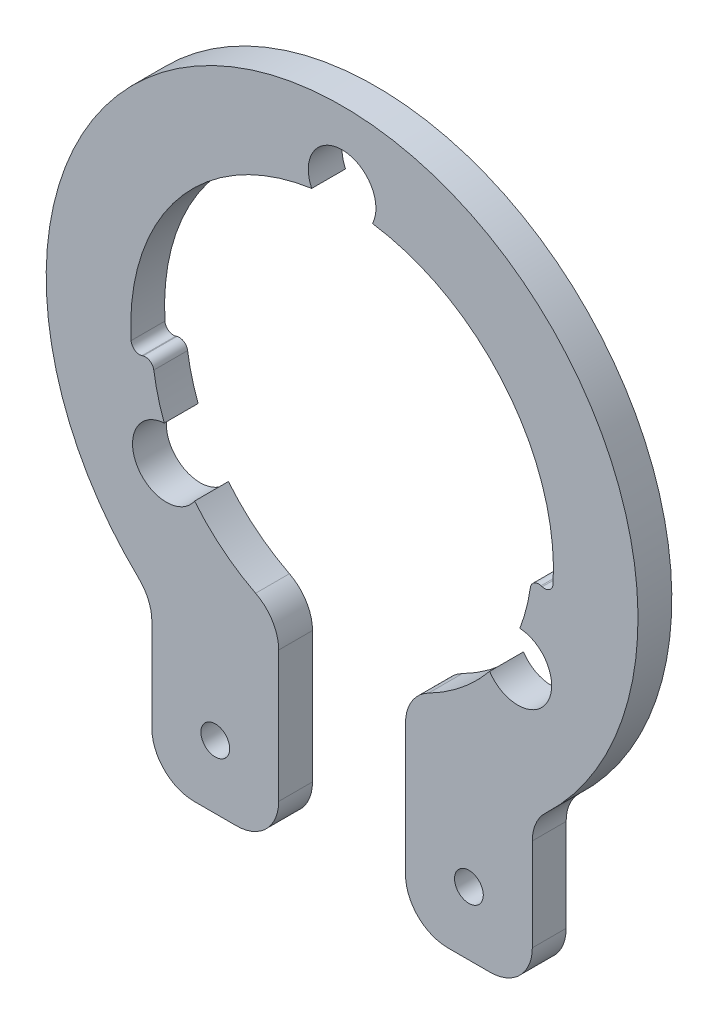
ISO-10303-21;
HEADER;
FILE_DESCRIPTION(('STEP AP214'),'2;1');
FILE_NAME('part.step','',(''),(''),'','','');
FILE_SCHEMA(('AUTOMOTIVE_DESIGN { 1 0 10303 214 1 1 1 1 }'));
ENDSEC;
DATA;
#1=APPLICATION_CONTEXT('core data for automotive mechanical design processes');
#2=APPLICATION_PROTOCOL_DEFINITION('international standard','automotive_design',2000,#1);
#3=PRODUCT_CONTEXT('',#1,'mechanical');
#4=PRODUCT('Part','Part','',(#3));
#5=PRODUCT_RELATED_PRODUCT_CATEGORY('part','',(#4));
#6=PRODUCT_DEFINITION_FORMATION('','',#4);
#7=PRODUCT_DEFINITION_CONTEXT('part definition',#1,'design');
#8=PRODUCT_DEFINITION('design','',#6,#7);
#9=PRODUCT_DEFINITION_SHAPE('','',#8);
#10=(LENGTH_UNIT() NAMED_UNIT(*) SI_UNIT(.MILLI.,.METRE.));
#11=(NAMED_UNIT(*) PLANE_ANGLE_UNIT() SI_UNIT($,.RADIAN.));
#12=(NAMED_UNIT(*) SI_UNIT($,.STERADIAN.) SOLID_ANGLE_UNIT());
#13=UNCERTAINTY_MEASURE_WITH_UNIT(LENGTH_MEASURE(1.E-05),#10,'distance_accuracy_value','');
#14=(GEOMETRIC_REPRESENTATION_CONTEXT(3) GLOBAL_UNCERTAINTY_ASSIGNED_CONTEXT((#13)) GLOBAL_UNIT_ASSIGNED_CONTEXT((#10,
#11,#12)) REPRESENTATION_CONTEXT('',''));
#15=CARTESIAN_POINT('',(0.,0.,0.));
#16=DIRECTION('',(0.,0.,1.));
#17=DIRECTION('',(1.,0.,0.));
#18=AXIS2_PLACEMENT_3D('',#15,#16,#17);
#19=CARTESIAN_POINT('',(0.,0.,4.));
#20=DIRECTION('',(0.,0.,1.));
#21=DIRECTION('',(1.,0.,0.));
#22=AXIS2_PLACEMENT_3D('',#19,#20,#21);
#23=PLANE('',#22);
#24=CARTESIAN_POINT('',(-15.,-37.5,4.));
#25=DIRECTION('',(0.,0.,1.));
#26=DIRECTION('',(1.,0.,0.));
#27=AXIS2_PLACEMENT_3D('',#24,#25,#26);
#28=CIRCLE('',#27,1.7);
#29=CARTESIAN_POINT('',(-13.3,-37.5,4.));
#30=VERTEX_POINT('',#29);
#31=EDGE_CURVE('E241',#30,#30,#28,.T.);
#32=ORIENTED_EDGE('',*,*,#31,.F.);
#33=EDGE_LOOP('',(#32));
#34=FACE_BOUND('',#33,.T.);
#35=CARTESIAN_POINT('',(20.7846096908266,-11.9999999999999,4.));
#36=DIRECTION('',(0.,0.,1.));
#37=DIRECTION('',(-1.,0.,0.));
#38=AXIS2_PLACEMENT_3D('',#35,#36,#37);
#39=CIRCLE('',#38,10.);
#40=CARTESIAN_POINT('',(23.666904134747,-2.42438624742276,4.));
#41=VERTEX_POINT('',#40);
#42=CARTESIAN_POINT('',(23.5354845132423,-2.38580800527676,4.));
#43=VERTEX_POINT('',#42);
#44=EDGE_CURVE('E407',#41,#43,#39,.T.);
#45=ORIENTED_EDGE('',*,*,#44,.T.);
#46=CARTESIAN_POINT('',(23.2603970310007,-3.34722720474908,4.));
#47=DIRECTION('',(0.,0.,1.));
#48=DIRECTION('',(1.,0.,0.));
#49=AXIS2_PLACEMENT_3D('',#46,#47,#48);
#50=CIRCLE('',#49,1.);
#51=CARTESIAN_POINT('',(22.270592902022,-3.20479200454699,4.));
#52=VERTEX_POINT('',#51);
#53=EDGE_CURVE('E373',#43,#52,#50,.T.);
#54=ORIENTED_EDGE('',*,*,#53,.T.);
#55=CARTESIAN_POINT('',(0.,0.,4.));
#56=DIRECTION('',(0.,0.,-1.));
#57=DIRECTION('',(1.,0.,0.));
#58=AXIS2_PLACEMENT_3D('',#55,#56,#57);
#59=CIRCLE('',#58,22.5);
#60=CARTESIAN_POINT('',(21.0269442842317,-8.00734750512395,4.));
#61=VERTEX_POINT('',#60);
#62=EDGE_CURVE('E417',#52,#61,#59,.T.);
#63=ORIENTED_EDGE('',*,*,#62,.T.);
#64=CARTESIAN_POINT('',(20.7846096908266,-11.9999999999999,4.));
#65=DIRECTION('',(0.,0.,1.));
#66=DIRECTION('',(-1.,0.,0.));
#67=AXIS2_PLACEMENT_3D('',#64,#65,#66);
#68=CIRCLE('',#67,4.);
#69=CARTESIAN_POINT('',(17.4480384984833,-14.2061941615426,4.));
#70=VERTEX_POINT('',#69);
#71=EDGE_CURVE('E240',#70,#61,#68,.T.);
#72=ORIENTED_EDGE('',*,*,#71,.F.);
#73=CARTESIAN_POINT('',(10.2272727272727,-20.0412797136805,4.));
#74=VERTEX_POINT('',#73);
#75=EDGE_CURVE('E250',#70,#74,#59,.T.);
#76=ORIENTED_EDGE('',*,*,#75,.T.);
#77=CARTESIAN_POINT('',(12.5,-24.4948974278318,4.));
#78=DIRECTION('',(0.,0.,1.));
#79=DIRECTION('',(1.,0.,0.));
#80=AXIS2_PLACEMENT_3D('',#77,#78,#79);
#81=CIRCLE('',#80,5.);
#82=CARTESIAN_POINT('',(7.5,-24.4948974278318,4.));
#83=VERTEX_POINT('',#82);
#84=EDGE_CURVE('E333',#74,#83,#81,.T.);
#85=ORIENTED_EDGE('',*,*,#84,.T.);
#86=DIRECTION('',(0.,-1.,0.));
#87=VECTOR('',#86,1.);
#88=CARTESIAN_POINT('',(7.5,-21.2132034355964,4.));
#89=LINE('',#88,#87);
#90=CARTESIAN_POINT('',(7.5,-40.,4.));
#91=VERTEX_POINT('',#90);
#92=EDGE_CURVE('E419',#83,#91,#89,.T.);
#93=ORIENTED_EDGE('',*,*,#92,.T.);
#94=CARTESIAN_POINT('',(12.5,-40.,4.));
#95=DIRECTION('',(0.,0.,1.));
#96=DIRECTION('',(1.,0.,0.));
#97=AXIS2_PLACEMENT_3D('',#94,#95,#96);
#98=CIRCLE('',#97,5.);
#99=CARTESIAN_POINT('',(12.5,-45.,4.));
#100=VERTEX_POINT('',#99);
#101=EDGE_CURVE('E335',#91,#100,#98,.T.);
#102=ORIENTED_EDGE('',*,*,#101,.T.);
#103=DIRECTION('',(1.,0.,0.));
#104=VECTOR('',#103,1.);
#105=CARTESIAN_POINT('',(7.5,-45.,4.));
#106=LINE('',#105,#104);
#107=CARTESIAN_POINT('',(17.5,-45.,4.));
#108=VERTEX_POINT('',#107);
#109=EDGE_CURVE('E422',#100,#108,#106,.T.);
#110=ORIENTED_EDGE('',*,*,#109,.T.);
#111=CARTESIAN_POINT('',(17.5,-40.,4.));
#112=DIRECTION('',(0.,0.,1.));
#113=DIRECTION('',(1.,0.,0.));
#114=AXIS2_PLACEMENT_3D('',#111,#112,#113);
#115=CIRCLE('',#114,5.);
#116=CARTESIAN_POINT('',(22.5,-40.,4.));
#117=VERTEX_POINT('',#116);
#118=EDGE_CURVE('E296',#108,#117,#115,.T.);
#119=ORIENTED_EDGE('',*,*,#118,.T.);
#120=DIRECTION('',(0.,1.,0.));
#121=VECTOR('',#120,1.);
#122=CARTESIAN_POINT('',(22.5,-45.,4.));
#123=LINE('',#122,#121);
#124=CARTESIAN_POINT('',(22.5,-29.0473750965556,4.));
#125=VERTEX_POINT('',#124);
#126=EDGE_CURVE('E277',#117,#125,#123,.T.);
#127=ORIENTED_EDGE('',*,*,#126,.T.);
#128=CARTESIAN_POINT('',(27.5,-29.0473750965556,4.));
#129=DIRECTION('',(0.,0.,1.));
#130=DIRECTION('',(1.,0.,0.));
#131=AXIS2_PLACEMENT_3D('',#128,#129,#130);
#132=CIRCLE('',#131,5.);
#133=CARTESIAN_POINT('',(24.0625,-25.4164532094862,4.));
#134=VERTEX_POINT('',#133);
#135=EDGE_CURVE('E351',#125,#134,#132,.F.);
#136=ORIENTED_EDGE('',*,*,#135,.T.);
#137=CARTESIAN_POINT('',(0.,0.,4.));
#138=DIRECTION('',(0.,0.,1.));
#139=DIRECTION('',(1.,0.,0.));
#140=AXIS2_PLACEMENT_3D('',#137,#138,#139);
#141=CIRCLE('',#140,35.);
#142=CARTESIAN_POINT('',(-24.0625,-25.4164532094862,4.));
#143=VERTEX_POINT('',#142);
#144=EDGE_CURVE('E273',#134,#143,#141,.T.);
#145=ORIENTED_EDGE('',*,*,#144,.T.);
#146=CARTESIAN_POINT('',(-27.5,-29.0473750965556,4.));
#147=DIRECTION('',(0.,0.,1.));
#148=DIRECTION('',(1.,0.,0.));
#149=AXIS2_PLACEMENT_3D('',#146,#147,#148);
#150=CIRCLE('',#149,5.);
#151=CARTESIAN_POINT('',(-22.5,-29.0473750965556,4.));
#152=VERTEX_POINT('',#151);
#153=EDGE_CURVE('E355',#143,#152,#150,.F.);
#154=ORIENTED_EDGE('',*,*,#153,.T.);
#155=DIRECTION('',(0.,-1.,0.));
#156=VECTOR('',#155,1.);
#157=CARTESIAN_POINT('',(-22.5,-45.,4.));
#158=LINE('',#157,#156);
#159=CARTESIAN_POINT('',(-22.5,-40.,4.));
#160=VERTEX_POINT('',#159);
#161=EDGE_CURVE('E529',#152,#160,#158,.T.);
#162=ORIENTED_EDGE('',*,*,#161,.T.);
#163=CARTESIAN_POINT('',(-17.5,-40.,4.));
#164=DIRECTION('',(0.,0.,1.));
#165=DIRECTION('',(1.,0.,0.));
#166=AXIS2_PLACEMENT_3D('',#163,#164,#165);
#167=CIRCLE('',#166,5.);
#168=CARTESIAN_POINT('',(-17.5,-45.,4.));
#169=VERTEX_POINT('',#168);
#170=EDGE_CURVE('E294',#160,#169,#167,.T.);
#171=ORIENTED_EDGE('',*,*,#170,.T.);
#172=DIRECTION('',(1.,0.,0.));
#173=VECTOR('',#172,1.);
#174=CARTESIAN_POINT('',(-7.5,-45.,4.));
#175=LINE('',#174,#173);
#176=CARTESIAN_POINT('',(-12.5,-45.,4.));
#177=VERTEX_POINT('',#176);
#178=EDGE_CURVE('E531',#169,#177,#175,.T.);
#179=ORIENTED_EDGE('',*,*,#178,.T.);
#180=CARTESIAN_POINT('',(-12.5,-40.,4.));
#181=DIRECTION('',(0.,0.,1.));
#182=DIRECTION('',(1.,0.,0.));
#183=AXIS2_PLACEMENT_3D('',#180,#181,#182);
#184=CIRCLE('',#183,5.);
#185=CARTESIAN_POINT('',(-7.5,-40.,4.));
#186=VERTEX_POINT('',#185);
#187=EDGE_CURVE('E331',#177,#186,#184,.T.);
#188=ORIENTED_EDGE('',*,*,#187,.T.);
#189=DIRECTION('',(0.,1.,0.));
#190=VECTOR('',#189,1.);
#191=CARTESIAN_POINT('',(-7.5,-21.2132034355964,4.));
#192=LINE('',#191,#190);
#193=CARTESIAN_POINT('',(-7.5,-24.4948974278318,4.));
#194=VERTEX_POINT('',#193);
#195=EDGE_CURVE('E538',#186,#194,#192,.T.);
#196=ORIENTED_EDGE('',*,*,#195,.T.);
#197=CARTESIAN_POINT('',(-12.5,-24.4948974278318,4.));
#198=DIRECTION('',(0.,0.,1.));
#199=DIRECTION('',(1.,0.,0.));
#200=AXIS2_PLACEMENT_3D('',#197,#198,#199);
#201=CIRCLE('',#200,5.);
#202=CARTESIAN_POINT('',(-10.2272727272727,-20.0412797136805,4.));
#203=VERTEX_POINT('',#202);
#204=EDGE_CURVE('E329',#194,#203,#201,.T.);
#205=ORIENTED_EDGE('',*,*,#204,.T.);
#206=CARTESIAN_POINT('',(0.,0.,4.));
#207=DIRECTION('',(0.,0.,-1.));
#208=DIRECTION('',(-1.,0.,0.));
#209=AXIS2_PLACEMENT_3D('',#206,#207,#208);
#210=CIRCLE('',#209,22.5);
#211=CARTESIAN_POINT('',(-17.4480384984832,-14.2061941615426,4.));
#212=VERTEX_POINT('',#211);
#213=EDGE_CURVE('E541',#203,#212,#210,.T.);
#214=ORIENTED_EDGE('',*,*,#213,.T.);
#215=CARTESIAN_POINT('',(-20.7846096908266,-12.,4.));
#216=DIRECTION('',(0.,0.,1.));
#217=DIRECTION('',(1.,0.,0.));
#218=AXIS2_PLACEMENT_3D('',#215,#216,#217);
#219=CIRCLE('',#218,4.);
#220=CARTESIAN_POINT('',(-21.0269442842317,-8.007347505124,4.));
#221=VERTEX_POINT('',#220);
#222=EDGE_CURVE('E548',#221,#212,#219,.T.);
#223=ORIENTED_EDGE('',*,*,#222,.F.);
#224=CARTESIAN_POINT('',(-22.270592902022,-3.20479200454701,4.));
#225=VERTEX_POINT('',#224);
#226=EDGE_CURVE('E540',#221,#225,#210,.T.);
#227=ORIENTED_EDGE('',*,*,#226,.T.);
#228=CARTESIAN_POINT('',(-23.2603970310007,-3.3472272047491,4.));
#229=DIRECTION('',(0.,0.,1.));
#230=DIRECTION('',(1.,0.,0.));
#231=AXIS2_PLACEMENT_3D('',#228,#229,#230);
#232=CIRCLE('',#231,1.);
#233=CARTESIAN_POINT('',(-23.5354845132423,-2.38580800527679,4.));
#234=VERTEX_POINT('',#233);
#235=EDGE_CURVE('E371',#225,#234,#232,.T.);
#236=ORIENTED_EDGE('',*,*,#235,.T.);
#237=CARTESIAN_POINT('',(-20.7846096908266,-12.,4.));
#238=DIRECTION('',(0.,0.,1.));
#239=DIRECTION('',(1.,0.,0.));
#240=AXIS2_PLACEMENT_3D('',#237,#238,#239);
#241=CIRCLE('',#240,10.);
#242=CARTESIAN_POINT('',(-23.666904134747,-2.42438624742279,4.));
#243=VERTEX_POINT('',#242);
#244=EDGE_CURVE('E413',#234,#243,#241,.T.);
#245=ORIENTED_EDGE('',*,*,#244,.T.);
#246=CARTESIAN_POINT('',(-23.9551335791391,-1.46682487216507,4.));
#247=DIRECTION('',(0.,0.,1.));
#248=DIRECTION('',(1.,0.,0.));
#249=AXIS2_PLACEMENT_3D('',#246,#247,#248);
#250=CIRCLE('',#249,1.);
#251=CARTESIAN_POINT('',(-24.9532641449366,-1.52794257517195,4.));
#252=VERTEX_POINT('',#251);
#253=EDGE_CURVE('E11',#243,#252,#250,.F.);
#254=ORIENTED_EDGE('',*,*,#253,.T.);
#255=CARTESIAN_POINT('',(0.,0.,4.));
#256=DIRECTION('',(0.,0.,-1.));
#257=DIRECTION('',(1.,0.,0.));
#258=AXIS2_PLACEMENT_3D('',#255,#256,#257);
#259=CIRCLE('',#258,25.);
#260=CARTESIAN_POINT('',(-3.59226838257269,24.7405660377358,4.));
#261=VERTEX_POINT('',#260);
#262=EDGE_CURVE('E403',#252,#261,#259,.T.);
#263=ORIENTED_EDGE('',*,*,#262,.T.);
#264=CARTESIAN_POINT('',(0.,26.5,4.));
#265=DIRECTION('',(0.,0.,1.));
#266=DIRECTION('',(1.,0.,0.));
#267=AXIS2_PLACEMENT_3D('',#264,#265,#266);
#268=CIRCLE('',#267,4.);
#269=CARTESIAN_POINT('',(3.5922683825727,24.7405660377358,4.));
#270=VERTEX_POINT('',#269);
#271=EDGE_CURVE('E561',#270,#261,#268,.T.);
#272=ORIENTED_EDGE('',*,*,#271,.F.);
#273=CARTESIAN_POINT('',(24.9532641449366,-1.52794257517192,4.));
#274=VERTEX_POINT('',#273);
#275=EDGE_CURVE('E408',#270,#274,#259,.T.);
#276=ORIENTED_EDGE('',*,*,#275,.T.);
#277=CARTESIAN_POINT('',(23.9551335791391,-1.46682487216504,4.));
#278=DIRECTION('',(0.,0.,1.));
#279=DIRECTION('',(1.,0.,0.));
#280=AXIS2_PLACEMENT_3D('',#277,#278,#279);
#281=CIRCLE('',#280,1.);
#282=EDGE_CURVE('E386',#274,#41,#281,.F.);
#283=ORIENTED_EDGE('',*,*,#282,.T.);
#284=EDGE_LOOP('',(#45,#54,#63,#72,#76,#85,#93,#102,#110,#119,#127,#136,#145,#154,#162,#171,
#179,#188,#196,#205,#214,#223,#227,#236,#245,#254,#263,#272,#276,#283));
#285=FACE_BOUND('',#284,.T.);
#286=CARTESIAN_POINT('',(15.,-37.5,4.));
#287=DIRECTION('',(0.,0.,1.));
#288=DIRECTION('',(-1.,0.,0.));
#289=AXIS2_PLACEMENT_3D('',#286,#287,#288);
#290=CIRCLE('',#289,1.7);
#291=CARTESIAN_POINT('',(13.3,-37.5,4.));
#292=VERTEX_POINT('',#291);
#293=EDGE_CURVE('E590',#292,#292,#290,.T.);
#294=ORIENTED_EDGE('',*,*,#293,.F.);
#295=EDGE_LOOP('',(#294));
#296=FACE_BOUND('',#295,.T.);
#297=ADVANCED_FACE('F32',(#34,#285,#296),#23,.T.);
#298=CARTESIAN_POINT('',(0.,0.,0.));
#299=DIRECTION('',(0.,0.,1.));
#300=DIRECTION('',(1.,0.,0.));
#301=AXIS2_PLACEMENT_3D('',#298,#299,#300);
#302=PLANE('',#301);
#303=CARTESIAN_POINT('',(-15.,-37.5,0.));
#304=DIRECTION('',(0.,0.,1.));
#305=DIRECTION('',(1.,0.,0.));
#306=AXIS2_PLACEMENT_3D('',#303,#304,#305);
#307=CIRCLE('',#306,1.7);
#308=CARTESIAN_POINT('',(-13.3,-37.5,0.));
#309=VERTEX_POINT('',#308);
#310=EDGE_CURVE('E595',#309,#309,#307,.T.);
#311=ORIENTED_EDGE('',*,*,#310,.T.);
#312=EDGE_LOOP('',(#311));
#313=FACE_BOUND('',#312,.T.);
#314=CARTESIAN_POINT('',(0.,0.,0.));
#315=DIRECTION('',(0.,0.,-1.));
#316=DIRECTION('',(1.,0.,0.));
#317=AXIS2_PLACEMENT_3D('',#314,#315,#316);
#318=CIRCLE('',#317,22.5);
#319=CARTESIAN_POINT('',(22.270592902022,-3.20479200454699,0.));
#320=VERTEX_POINT('',#319);
#321=CARTESIAN_POINT('',(21.0269442842317,-8.00734750512395,0.));
#322=VERTEX_POINT('',#321);
#323=EDGE_CURVE('E257',#320,#322,#318,.T.);
#324=ORIENTED_EDGE('',*,*,#323,.F.);
#325=CARTESIAN_POINT('',(23.2603970310007,-3.34722720474908,0.));
#326=DIRECTION('',(0.,0.,1.));
#327=DIRECTION('',(1.,0.,0.));
#328=AXIS2_PLACEMENT_3D('',#325,#326,#327);
#329=CIRCLE('',#328,1.);
#330=CARTESIAN_POINT('',(23.5354845132423,-2.38580800527676,0.));
#331=VERTEX_POINT('',#330);
#332=EDGE_CURVE('E369',#320,#331,#329,.F.);
#333=ORIENTED_EDGE('',*,*,#332,.T.);
#334=CARTESIAN_POINT('',(20.7846096908266,-11.9999999999999,0.));
#335=DIRECTION('',(0.,0.,1.));
#336=DIRECTION('',(-1.,0.,0.));
#337=AXIS2_PLACEMENT_3D('',#334,#335,#336);
#338=CIRCLE('',#337,10.);
#339=CARTESIAN_POINT('',(23.666904134747,-2.42438624742276,0.));
#340=VERTEX_POINT('',#339);
#341=EDGE_CURVE('E258',#340,#331,#338,.T.);
#342=ORIENTED_EDGE('',*,*,#341,.F.);
#343=CARTESIAN_POINT('',(23.9551335791391,-1.46682487216504,0.));
#344=DIRECTION('',(0.,0.,1.));
#345=DIRECTION('',(1.,0.,0.));
#346=AXIS2_PLACEMENT_3D('',#343,#344,#345);
#347=CIRCLE('',#346,1.);
#348=CARTESIAN_POINT('',(24.9532641449366,-1.52794257517192,0.));
#349=VERTEX_POINT('',#348);
#350=EDGE_CURVE('E384',#340,#349,#347,.T.);
#351=ORIENTED_EDGE('',*,*,#350,.T.);
#352=CARTESIAN_POINT('',(0.,0.,0.));
#353=DIRECTION('',(0.,0.,-1.));
#354=DIRECTION('',(1.,0.,0.));
#355=AXIS2_PLACEMENT_3D('',#352,#353,#354);
#356=CIRCLE('',#355,25.);
#357=CARTESIAN_POINT('',(3.5922683825727,24.7405660377358,0.));
#358=VERTEX_POINT('',#357);
#359=EDGE_CURVE('E395',#358,#349,#356,.T.);
#360=ORIENTED_EDGE('',*,*,#359,.F.);
#361=CARTESIAN_POINT('',(0.,26.5,0.));
#362=DIRECTION('',(0.,0.,1.));
#363=DIRECTION('',(1.,0.,0.));
#364=AXIS2_PLACEMENT_3D('',#361,#362,#363);
#365=CIRCLE('',#364,4.);
#366=CARTESIAN_POINT('',(-3.59226838257269,24.7405660377358,0.));
#367=VERTEX_POINT('',#366);
#368=EDGE_CURVE('E274',#367,#358,#365,.F.);
#369=ORIENTED_EDGE('',*,*,#368,.F.);
#370=CARTESIAN_POINT('',(-24.9532641449366,-1.52794257517195,0.));
#371=VERTEX_POINT('',#370);
#372=EDGE_CURVE('E262',#371,#367,#356,.T.);
#373=ORIENTED_EDGE('',*,*,#372,.F.);
#374=CARTESIAN_POINT('',(-23.9551335791391,-1.46682487216507,0.));
#375=DIRECTION('',(0.,0.,1.));
#376=DIRECTION('',(1.,0.,0.));
#377=AXIS2_PLACEMENT_3D('',#374,#375,#376);
#378=CIRCLE('',#377,1.);
#379=CARTESIAN_POINT('',(-23.666904134747,-2.42438624742279,0.));
#380=VERTEX_POINT('',#379);
#381=EDGE_CURVE('E40',#371,#380,#378,.T.);
#382=ORIENTED_EDGE('',*,*,#381,.T.);
#383=CARTESIAN_POINT('',(-20.7846096908266,-12.,0.));
#384=DIRECTION('',(0.,0.,1.));
#385=DIRECTION('',(1.,0.,0.));
#386=AXIS2_PLACEMENT_3D('',#383,#384,#385);
#387=CIRCLE('',#386,10.);
#388=CARTESIAN_POINT('',(-23.5354845132423,-2.38580800527679,0.));
#389=VERTEX_POINT('',#388);
#390=EDGE_CURVE('E389',#389,#380,#387,.T.);
#391=ORIENTED_EDGE('',*,*,#390,.F.);
#392=CARTESIAN_POINT('',(-23.2603970310007,-3.3472272047491,0.));
#393=DIRECTION('',(0.,0.,1.));
#394=DIRECTION('',(1.,0.,0.));
#395=AXIS2_PLACEMENT_3D('',#392,#393,#394);
#396=CIRCLE('',#395,1.);
#397=CARTESIAN_POINT('',(-22.270592902022,-3.20479200454701,0.));
#398=VERTEX_POINT('',#397);
#399=EDGE_CURVE('E367',#389,#398,#396,.F.);
#400=ORIENTED_EDGE('',*,*,#399,.T.);
#401=CARTESIAN_POINT('',(0.,0.,0.));
#402=DIRECTION('',(0.,0.,-1.));
#403=DIRECTION('',(-1.,0.,0.));
#404=AXIS2_PLACEMENT_3D('',#401,#402,#403);
#405=CIRCLE('',#404,22.5);
#406=CARTESIAN_POINT('',(-21.0269442842317,-8.007347505124,0.));
#407=VERTEX_POINT('',#406);
#408=EDGE_CURVE('E438',#407,#398,#405,.T.);
#409=ORIENTED_EDGE('',*,*,#408,.F.);
#410=CARTESIAN_POINT('',(-20.7846096908266,-12.,0.));
#411=DIRECTION('',(0.,0.,1.));
#412=DIRECTION('',(1.,0.,0.));
#413=AXIS2_PLACEMENT_3D('',#410,#411,#412);
#414=CIRCLE('',#413,4.);
#415=CARTESIAN_POINT('',(-17.4480384984832,-14.2061941615426,0.));
#416=VERTEX_POINT('',#415);
#417=EDGE_CURVE('E558',#407,#416,#414,.T.);
#418=ORIENTED_EDGE('',*,*,#417,.T.);
#419=CARTESIAN_POINT('',(-10.2272727272727,-20.0412797136805,0.));
#420=VERTEX_POINT('',#419);
#421=EDGE_CURVE('E396',#420,#416,#405,.T.);
#422=ORIENTED_EDGE('',*,*,#421,.F.);
#423=CARTESIAN_POINT('',(-12.5,-24.4948974278318,0.));
#424=DIRECTION('',(0.,0.,1.));
#425=DIRECTION('',(1.,0.,0.));
#426=AXIS2_PLACEMENT_3D('',#423,#424,#425);
#427=CIRCLE('',#426,5.);
#428=CARTESIAN_POINT('',(-7.5,-24.4948974278318,0.));
#429=VERTEX_POINT('',#428);
#430=EDGE_CURVE('E317',#420,#429,#427,.F.);
#431=ORIENTED_EDGE('',*,*,#430,.T.);
#432=DIRECTION('',(0.,1.,0.));
#433=VECTOR('',#432,1.);
#434=CARTESIAN_POINT('',(-7.5,-21.2132034355964,0.));
#435=LINE('',#434,#433);
#436=CARTESIAN_POINT('',(-7.5,-40.,0.));
#437=VERTEX_POINT('',#436);
#438=EDGE_CURVE('E435',#437,#429,#435,.T.);
#439=ORIENTED_EDGE('',*,*,#438,.F.);
#440=CARTESIAN_POINT('',(-12.5,-40.,0.));
#441=DIRECTION('',(0.,0.,1.));
#442=DIRECTION('',(1.,0.,0.));
#443=AXIS2_PLACEMENT_3D('',#440,#441,#442);
#444=CIRCLE('',#443,5.);
#445=CARTESIAN_POINT('',(-12.5,-45.,0.));
#446=VERTEX_POINT('',#445);
#447=EDGE_CURVE('E319',#437,#446,#444,.F.);
#448=ORIENTED_EDGE('',*,*,#447,.T.);
#449=DIRECTION('',(1.,0.,0.));
#450=VECTOR('',#449,1.);
#451=CARTESIAN_POINT('',(-7.5,-45.,0.));
#452=LINE('',#451,#450);
#453=CARTESIAN_POINT('',(-17.5,-45.,0.));
#454=VERTEX_POINT('',#453);
#455=EDGE_CURVE('E432',#454,#446,#452,.T.);
#456=ORIENTED_EDGE('',*,*,#455,.F.);
#457=CARTESIAN_POINT('',(-17.5,-40.,0.));
#458=DIRECTION('',(0.,0.,1.));
#459=DIRECTION('',(1.,0.,0.));
#460=AXIS2_PLACEMENT_3D('',#457,#458,#459);
#461=CIRCLE('',#460,5.);
#462=CARTESIAN_POINT('',(-22.5,-40.,0.));
#463=VERTEX_POINT('',#462);
#464=EDGE_CURVE('E285',#454,#463,#461,.F.);
#465=ORIENTED_EDGE('',*,*,#464,.T.);
#466=DIRECTION('',(0.,-1.,0.));
#467=VECTOR('',#466,1.);
#468=CARTESIAN_POINT('',(-22.5,-45.,0.));
#469=LINE('',#468,#467);
#470=CARTESIAN_POINT('',(-22.5,-29.0473750965556,0.));
#471=VERTEX_POINT('',#470);
#472=EDGE_CURVE('E429',#471,#463,#469,.T.);
#473=ORIENTED_EDGE('',*,*,#472,.F.);
#474=CARTESIAN_POINT('',(-27.5,-29.0473750965556,0.));
#475=DIRECTION('',(0.,0.,1.));
#476=DIRECTION('',(1.,0.,0.));
#477=AXIS2_PLACEMENT_3D('',#474,#475,#476);
#478=CIRCLE('',#477,5.);
#479=CARTESIAN_POINT('',(-24.0625,-25.4164532094862,0.));
#480=VERTEX_POINT('',#479);
#481=EDGE_CURVE('E353',#471,#480,#478,.T.);
#482=ORIENTED_EDGE('',*,*,#481,.T.);
#483=CARTESIAN_POINT('',(0.,0.,0.));
#484=DIRECTION('',(0.,0.,1.));
#485=DIRECTION('',(1.,0.,0.));
#486=AXIS2_PLACEMENT_3D('',#483,#484,#485);
#487=CIRCLE('',#486,35.);
#488=CARTESIAN_POINT('',(24.0625,-25.4164532094862,0.));
#489=VERTEX_POINT('',#488);
#490=EDGE_CURVE('E426',#489,#480,#487,.T.);
#491=ORIENTED_EDGE('',*,*,#490,.F.);
#492=CARTESIAN_POINT('',(27.5,-29.0473750965556,0.));
#493=DIRECTION('',(0.,0.,1.));
#494=DIRECTION('',(1.,0.,0.));
#495=AXIS2_PLACEMENT_3D('',#492,#493,#494);
#496=CIRCLE('',#495,5.);
#497=CARTESIAN_POINT('',(22.5,-29.0473750965556,0.));
#498=VERTEX_POINT('',#497);
#499=EDGE_CURVE('E349',#489,#498,#496,.T.);
#500=ORIENTED_EDGE('',*,*,#499,.T.);
#501=DIRECTION('',(0.,1.,0.));
#502=VECTOR('',#501,1.);
#503=CARTESIAN_POINT('',(22.5,-45.,0.));
#504=LINE('',#503,#502);
#505=CARTESIAN_POINT('',(22.5,-40.,0.));
#506=VERTEX_POINT('',#505);
#507=EDGE_CURVE('E270',#506,#498,#504,.T.);
#508=ORIENTED_EDGE('',*,*,#507,.F.);
#509=CARTESIAN_POINT('',(17.5,-40.,0.));
#510=DIRECTION('',(0.,0.,1.));
#511=DIRECTION('',(1.,0.,0.));
#512=AXIS2_PLACEMENT_3D('',#509,#510,#511);
#513=CIRCLE('',#512,5.);
#514=CARTESIAN_POINT('',(17.5,-45.,0.));
#515=VERTEX_POINT('',#514);
#516=EDGE_CURVE('E288',#506,#515,#513,.F.);
#517=ORIENTED_EDGE('',*,*,#516,.T.);
#518=DIRECTION('',(1.,0.,0.));
#519=VECTOR('',#518,1.);
#520=CARTESIAN_POINT('',(7.5,-45.,0.));
#521=LINE('',#520,#519);
#522=CARTESIAN_POINT('',(12.5,-45.,0.));
#523=VERTEX_POINT('',#522);
#524=EDGE_CURVE('E268',#523,#515,#521,.T.);
#525=ORIENTED_EDGE('',*,*,#524,.F.);
#526=CARTESIAN_POINT('',(12.5,-40.,0.));
#527=DIRECTION('',(0.,0.,1.));
#528=DIRECTION('',(1.,0.,0.));
#529=AXIS2_PLACEMENT_3D('',#526,#527,#528);
#530=CIRCLE('',#529,5.);
#531=CARTESIAN_POINT('',(7.5,-40.,0.));
#532=VERTEX_POINT('',#531);
#533=EDGE_CURVE('E322',#523,#532,#530,.F.);
#534=ORIENTED_EDGE('',*,*,#533,.T.);
#535=DIRECTION('',(0.,-1.,0.));
#536=VECTOR('',#535,1.);
#537=CARTESIAN_POINT('',(7.5,-21.2132034355964,0.));
#538=LINE('',#537,#536);
#539=CARTESIAN_POINT('',(7.5,-24.4948974278318,0.));
#540=VERTEX_POINT('',#539);
#541=EDGE_CURVE('E260',#540,#532,#538,.T.);
#542=ORIENTED_EDGE('',*,*,#541,.F.);
#543=CARTESIAN_POINT('',(12.5,-24.4948974278318,0.));
#544=DIRECTION('',(0.,0.,1.));
#545=DIRECTION('',(1.,0.,0.));
#546=AXIS2_PLACEMENT_3D('',#543,#544,#545);
#547=CIRCLE('',#546,5.);
#548=CARTESIAN_POINT('',(10.2272727272727,-20.0412797136805,0.));
#549=VERTEX_POINT('',#548);
#550=EDGE_CURVE('E256',#540,#549,#547,.F.);
#551=ORIENTED_EDGE('',*,*,#550,.T.);
#552=CARTESIAN_POINT('',(17.4480384984833,-14.2061941615426,0.));
#553=VERTEX_POINT('',#552);
#554=EDGE_CURVE('E247',#553,#549,#318,.T.);
#555=ORIENTED_EDGE('',*,*,#554,.F.);
#556=CARTESIAN_POINT('',(20.7846096908266,-11.9999999999999,0.));
#557=DIRECTION('',(0.,0.,1.));
#558=DIRECTION('',(-1.,0.,0.));
#559=AXIS2_PLACEMENT_3D('',#556,#557,#558);
#560=CIRCLE('',#559,4.);
#561=EDGE_CURVE('E229',#553,#322,#560,.T.);
#562=ORIENTED_EDGE('',*,*,#561,.T.);
#563=EDGE_LOOP('',(#324,#333,#342,#351,#360,#369,#373,#382,#391,#400,#409,#418,#422,#431,#439,
#448,#456,#465,#473,#482,#491,#500,#508,#517,#525,#534,#542,#551,#555,#562));
#564=FACE_BOUND('',#563,.T.);
#565=CARTESIAN_POINT('',(15.,-37.5,0.));
#566=DIRECTION('',(0.,0.,1.));
#567=DIRECTION('',(-1.,0.,0.));
#568=AXIS2_PLACEMENT_3D('',#565,#566,#567);
#569=CIRCLE('',#568,1.7);
#570=CARTESIAN_POINT('',(13.3,-37.5,0.));
#571=VERTEX_POINT('',#570);
#572=EDGE_CURVE('E593',#571,#571,#569,.T.);
#573=ORIENTED_EDGE('',*,*,#572,.T.);
#574=EDGE_LOOP('',(#573));
#575=FACE_BOUND('',#574,.T.);
#576=ADVANCED_FACE('F253',(#313,#564,#575),#302,.F.);
#577=CARTESIAN_POINT('',(0.,0.,4.));
#578=DIRECTION('',(0.,0.,-1.));
#579=DIRECTION('',(-1.,0.,0.));
#580=AXIS2_PLACEMENT_3D('',#577,#578,#579);
#581=CYLINDRICAL_SURFACE('',#580,22.5);
#582=ORIENTED_EDGE('',*,*,#554,.T.);
#583=DIRECTION('',(0.,0.,-1.));
#584=VECTOR('',#583,1.);
#585=CARTESIAN_POINT('',(10.2272727272727,-20.0412797136806,4.));
#586=LINE('',#585,#584);
#587=EDGE_CURVE('E337',#549,#74,#586,.F.);
#588=ORIENTED_EDGE('',*,*,#587,.T.);
#589=ORIENTED_EDGE('',*,*,#75,.F.);
#590=DIRECTION('',(0.,0.,-1.));
#591=VECTOR('',#590,1.);
#592=CARTESIAN_POINT('',(17.4480384984833,-14.2061941615426,2.));
#593=LINE('',#592,#591);
#594=EDGE_CURVE('E233',#553,#70,#593,.F.);
#595=ORIENTED_EDGE('',*,*,#594,.F.);
#596=EDGE_LOOP('',(#582,#588,#589,#595));
#597=FACE_BOUND('',#596,.T.);
#598=ADVANCED_FACE('F246',(#597),#581,.F.);
#599=ORIENTED_EDGE('',*,*,#62,.F.);
#600=DIRECTION('',(0.,0.,-1.));
#601=VECTOR('',#600,1.);
#602=CARTESIAN_POINT('',(22.270592902022,-3.20479200454699,4.));
#603=LINE('',#602,#601);
#604=EDGE_CURVE('E364',#52,#320,#603,.T.);
#605=ORIENTED_EDGE('',*,*,#604,.T.);
#606=ORIENTED_EDGE('',*,*,#323,.T.);
#607=DIRECTION('',(0.,0.,-1.));
#608=VECTOR('',#607,1.);
#609=CARTESIAN_POINT('',(21.0269442842317,-8.00734750512395,2.));
#610=LINE('',#609,#608);
#611=EDGE_CURVE('E236',#61,#322,#610,.T.);
#612=ORIENTED_EDGE('',*,*,#611,.F.);
#613=EDGE_LOOP('',(#599,#605,#606,#612));
#614=FACE_BOUND('',#613,.T.);
#615=ADVANCED_FACE('F462',(#614),#581,.F.);
#616=CARTESIAN_POINT('',(0.,0.,4.));
#617=DIRECTION('',(0.,0.,-1.));
#618=DIRECTION('',(-1.,0.,0.));
#619=AXIS2_PLACEMENT_3D('',#616,#617,#618);
#620=CYLINDRICAL_SURFACE('',#619,22.5);
#621=ORIENTED_EDGE('',*,*,#408,.T.);
#622=DIRECTION('',(0.,0.,-1.));
#623=VECTOR('',#622,1.);
#624=CARTESIAN_POINT('',(-22.270592902022,-3.20479200454701,4.));
#625=LINE('',#624,#623);
#626=EDGE_CURVE('E382',#398,#225,#625,.F.);
#627=ORIENTED_EDGE('',*,*,#626,.T.);
#628=ORIENTED_EDGE('',*,*,#226,.F.);
#629=DIRECTION('',(0.,0.,-1.));
#630=VECTOR('',#629,1.);
#631=CARTESIAN_POINT('',(-21.0269442842317,-8.007347505124,2.));
#632=LINE('',#631,#630);
#633=EDGE_CURVE('E280',#407,#221,#632,.F.);
#634=ORIENTED_EDGE('',*,*,#633,.F.);
#635=EDGE_LOOP('',(#621,#627,#628,#634));
#636=FACE_BOUND('',#635,.T.);
#637=ADVANCED_FACE('F464',(#636),#620,.F.);
#638=ORIENTED_EDGE('',*,*,#213,.F.);
#639=DIRECTION('',(0.,0.,-1.));
#640=VECTOR('',#639,1.);
#641=CARTESIAN_POINT('',(-10.2272727272727,-20.0412797136806,4.));
#642=LINE('',#641,#640);
#643=EDGE_CURVE('E346',#203,#420,#642,.T.);
#644=ORIENTED_EDGE('',*,*,#643,.T.);
#645=ORIENTED_EDGE('',*,*,#421,.T.);
#646=DIRECTION('',(0.,0.,-1.));
#647=VECTOR('',#646,1.);
#648=CARTESIAN_POINT('',(-17.4480384984833,-14.2061941615426,2.));
#649=LINE('',#648,#647);
#650=EDGE_CURVE('E276',#212,#416,#649,.T.);
#651=ORIENTED_EDGE('',*,*,#650,.F.);
#652=EDGE_LOOP('',(#638,#644,#645,#651));
#653=FACE_BOUND('',#652,.T.);
#654=ADVANCED_FACE('F470',(#653),#620,.F.);
#655=CARTESIAN_POINT('',(0.,0.,4.));
#656=DIRECTION('',(0.,0.,-1.));
#657=DIRECTION('',(-1.,0.,0.));
#658=AXIS2_PLACEMENT_3D('',#655,#656,#657);
#659=CYLINDRICAL_SURFACE('',#658,25.);
#660=ORIENTED_EDGE('',*,*,#359,.T.);
#661=DIRECTION('',(0.,0.,-1.));
#662=VECTOR('',#661,1.);
#663=CARTESIAN_POINT('',(24.9532641449366,-1.52794257517192,4.));
#664=LINE('',#663,#662);
#665=EDGE_CURVE('E362',#349,#274,#664,.F.);
#666=ORIENTED_EDGE('',*,*,#665,.T.);
#667=ORIENTED_EDGE('',*,*,#275,.F.);
#668=DIRECTION('',(0.,0.,-1.));
#669=VECTOR('',#668,1.);
#670=CARTESIAN_POINT('',(3.5922683825727,24.7405660377358,2.));
#671=LINE('',#670,#669);
#672=EDGE_CURVE('E430',#358,#270,#671,.F.);
#673=ORIENTED_EDGE('',*,*,#672,.F.);
#674=EDGE_LOOP('',(#660,#666,#667,#673));
#675=FACE_BOUND('',#674,.T.);
#676=ADVANCED_FACE('F444',(#675),#659,.F.);
#677=ORIENTED_EDGE('',*,*,#262,.F.);
#678=DIRECTION('',(0.,0.,-1.));
#679=VECTOR('',#678,1.);
#680=CARTESIAN_POINT('',(-24.9532641449366,-1.52794257517195,4.));
#681=LINE('',#680,#679);
#682=EDGE_CURVE('E375',#252,#371,#681,.T.);
#683=ORIENTED_EDGE('',*,*,#682,.T.);
#684=ORIENTED_EDGE('',*,*,#372,.T.);
#685=DIRECTION('',(0.,0.,-1.));
#686=VECTOR('',#685,1.);
#687=CARTESIAN_POINT('',(-3.59226838257269,24.7405660377358,2.));
#688=LINE('',#687,#686);
#689=EDGE_CURVE('E404',#261,#367,#688,.T.);
#690=ORIENTED_EDGE('',*,*,#689,.F.);
#691=EDGE_LOOP('',(#677,#683,#684,#690));
#692=FACE_BOUND('',#691,.T.);
#693=ADVANCED_FACE('F400',(#692),#659,.F.);
#694=CARTESIAN_POINT('',(0.,0.,4.));
#695=DIRECTION('',(0.,0.,-1.));
#696=DIRECTION('',(-1.,0.,0.));
#697=AXIS2_PLACEMENT_3D('',#694,#695,#696);
#698=CYLINDRICAL_SURFACE('',#697,35.);
#699=ORIENTED_EDGE('',*,*,#144,.F.);
#700=DIRECTION('',(0.,0.,-1.));
#701=VECTOR('',#700,1.);
#702=CARTESIAN_POINT('',(24.0625,-25.4164532094862,4.));
#703=LINE('',#702,#701);
#704=EDGE_CURVE('E306',#134,#489,#703,.T.);
#705=ORIENTED_EDGE('',*,*,#704,.T.);
#706=ORIENTED_EDGE('',*,*,#490,.T.);
#707=DIRECTION('',(0.,0.,-1.));
#708=VECTOR('',#707,1.);
#709=CARTESIAN_POINT('',(-24.0625,-25.4164532094862,4.));
#710=LINE('',#709,#708);
#711=EDGE_CURVE('E304',#480,#143,#710,.F.);
#712=ORIENTED_EDGE('',*,*,#711,.T.);
#713=EDGE_LOOP('',(#699,#705,#706,#712));
#714=FACE_BOUND('',#713,.T.);
#715=ADVANCED_FACE('F526',(#714),#698,.T.);
#716=CARTESIAN_POINT('',(-22.5,-45.,4.));
#717=DIRECTION('',(1.,0.,0.));
#718=DIRECTION('',(0.,0.,-1.));
#719=AXIS2_PLACEMENT_3D('',#716,#717,#718);
#720=PLANE('',#719);
#721=ORIENTED_EDGE('',*,*,#161,.F.);
#722=DIRECTION('',(0.,0.,1.));
#723=VECTOR('',#722,1.);
#724=CARTESIAN_POINT('',(-22.5,-29.0473750965556,0.));
#725=LINE('',#724,#723);
#726=EDGE_CURVE('E311',#152,#471,#725,.F.);
#727=ORIENTED_EDGE('',*,*,#726,.T.);
#728=ORIENTED_EDGE('',*,*,#472,.T.);
#729=DIRECTION('',(0.,0.,-1.));
#730=VECTOR('',#729,1.);
#731=CARTESIAN_POINT('',(-22.5,-40.,4.));
#732=LINE('',#731,#730);
#733=EDGE_CURVE('E301',#463,#160,#732,.F.);
#734=ORIENTED_EDGE('',*,*,#733,.T.);
#735=EDGE_LOOP('',(#721,#727,#728,#734));
#736=FACE_BOUND('',#735,.T.);
#737=ADVANCED_FACE('F784',(#736),#720,.F.);
#738=CARTESIAN_POINT('',(-7.5,-45.,4.));
#739=DIRECTION('',(0.,1.,0.));
#740=DIRECTION('',(0.,0.,1.));
#741=AXIS2_PLACEMENT_3D('',#738,#739,#740);
#742=PLANE('',#741);
#743=ORIENTED_EDGE('',*,*,#455,.T.);
#744=DIRECTION('',(0.,0.,-1.));
#745=VECTOR('',#744,1.);
#746=CARTESIAN_POINT('',(-12.5,-45.,4.));
#747=LINE('',#746,#745);
#748=EDGE_CURVE('E344',#446,#177,#747,.F.);
#749=ORIENTED_EDGE('',*,*,#748,.T.);
#750=ORIENTED_EDGE('',*,*,#178,.F.);
#751=DIRECTION('',(0.,0.,-1.));
#752=VECTOR('',#751,1.);
#753=CARTESIAN_POINT('',(-17.5,-45.,4.));
#754=LINE('',#753,#752);
#755=EDGE_CURVE('E298',#169,#454,#754,.T.);
#756=ORIENTED_EDGE('',*,*,#755,.T.);
#757=EDGE_LOOP('',(#743,#749,#750,#756));
#758=FACE_BOUND('',#757,.T.);
#759=ADVANCED_FACE('F774',(#758),#742,.F.);
#760=CARTESIAN_POINT('',(-7.5,-21.2132034355964,4.));
#761=DIRECTION('',(-1.,0.,0.));
#762=DIRECTION('',(0.,-1.,0.));
#763=AXIS2_PLACEMENT_3D('',#760,#761,#762);
#764=PLANE('',#763);
#765=ORIENTED_EDGE('',*,*,#195,.F.);
#766=DIRECTION('',(0.,0.,-1.));
#767=VECTOR('',#766,1.);
#768=CARTESIAN_POINT('',(-7.5,-40.,4.));
#769=LINE('',#768,#767);
#770=EDGE_CURVE('E341',#186,#437,#769,.T.);
#771=ORIENTED_EDGE('',*,*,#770,.T.);
#772=ORIENTED_EDGE('',*,*,#438,.T.);
#773=DIRECTION('',(0.,0.,-1.));
#774=VECTOR('',#773,1.);
#775=CARTESIAN_POINT('',(-7.5,-24.4948974278318,4.));
#776=LINE('',#775,#774);
#777=EDGE_CURVE('E339',#429,#194,#776,.F.);
#778=ORIENTED_EDGE('',*,*,#777,.T.);
#779=EDGE_LOOP('',(#765,#771,#772,#778));
#780=FACE_BOUND('',#779,.T.);
#781=ADVANCED_FACE('F673',(#780),#764,.F.);
#782=CARTESIAN_POINT('',(-20.7846096908266,-12.,4.));
#783=DIRECTION('',(0.,0.,-1.));
#784=DIRECTION('',(-1.,0.,0.));
#785=AXIS2_PLACEMENT_3D('',#782,#783,#784);
#786=CYLINDRICAL_SURFACE('',#785,10.);
#787=ORIENTED_EDGE('',*,*,#390,.T.);
#788=DIRECTION('',(0.,0.,-1.));
#789=VECTOR('',#788,1.);
#790=CARTESIAN_POINT('',(-23.666904134747,-2.42438624742278,4.));
#791=LINE('',#790,#789);
#792=EDGE_CURVE('E53',#380,#243,#791,.F.);
#793=ORIENTED_EDGE('',*,*,#792,.T.);
#794=ORIENTED_EDGE('',*,*,#244,.F.);
#795=DIRECTION('',(0.,0.,-1.));
#796=VECTOR('',#795,1.);
#797=CARTESIAN_POINT('',(-23.5354845132423,-2.38580800527678,4.));
#798=LINE('',#797,#796);
#799=EDGE_CURVE('E378',#234,#389,#798,.T.);
#800=ORIENTED_EDGE('',*,*,#799,.T.);
#801=EDGE_LOOP('',(#787,#793,#794,#800));
#802=FACE_BOUND('',#801,.T.);
#803=ADVANCED_FACE('F393',(#802),#786,.T.);
#804=CARTESIAN_POINT('',(20.7846096908266,-11.9999999999999,4.));
#805=DIRECTION('',(0.,0.,-1.));
#806=DIRECTION('',(-1.,0.,0.));
#807=AXIS2_PLACEMENT_3D('',#804,#805,#806);
#808=CYLINDRICAL_SURFACE('',#807,10.);
#809=ORIENTED_EDGE('',*,*,#44,.F.);
#810=DIRECTION('',(0.,0.,-1.));
#811=VECTOR('',#810,1.);
#812=CARTESIAN_POINT('',(23.666904134747,-2.42438624742276,4.));
#813=LINE('',#812,#811);
#814=EDGE_CURVE('E359',#41,#340,#813,.T.);
#815=ORIENTED_EDGE('',*,*,#814,.T.);
#816=ORIENTED_EDGE('',*,*,#341,.T.);
#817=DIRECTION('',(0.,0.,-1.));
#818=VECTOR('',#817,1.);
#819=CARTESIAN_POINT('',(23.5354845132423,-2.38580800527676,4.));
#820=LINE('',#819,#818);
#821=EDGE_CURVE('E357',#331,#43,#820,.F.);
#822=ORIENTED_EDGE('',*,*,#821,.T.);
#823=EDGE_LOOP('',(#809,#815,#816,#822));
#824=FACE_BOUND('',#823,.T.);
#825=ADVANCED_FACE('F454',(#824),#808,.T.);
#826=CARTESIAN_POINT('',(7.5,-21.2132034355964,4.));
#827=DIRECTION('',(1.,0.,0.));
#828=DIRECTION('',(0.,1.,0.));
#829=AXIS2_PLACEMENT_3D('',#826,#827,#828);
#830=PLANE('',#829);
#831=ORIENTED_EDGE('',*,*,#541,.T.);
#832=DIRECTION('',(0.,0.,-1.));
#833=VECTOR('',#832,1.);
#834=CARTESIAN_POINT('',(7.5,-40.,4.));
#835=LINE('',#834,#833);
#836=EDGE_CURVE('E327',#532,#91,#835,.F.);
#837=ORIENTED_EDGE('',*,*,#836,.T.);
#838=ORIENTED_EDGE('',*,*,#92,.F.);
#839=DIRECTION('',(0.,0.,-1.));
#840=VECTOR('',#839,1.);
#841=CARTESIAN_POINT('',(7.5,-24.4948974278318,4.));
#842=LINE('',#841,#840);
#843=EDGE_CURVE('E324',#83,#540,#842,.T.);
#844=ORIENTED_EDGE('',*,*,#843,.T.);
#845=EDGE_LOOP('',(#831,#837,#838,#844));
#846=FACE_BOUND('',#845,.T.);
#847=ADVANCED_FACE('F494',(#846),#830,.F.);
#848=CARTESIAN_POINT('',(7.5,-45.,4.));
#849=DIRECTION('',(0.,1.,0.));
#850=DIRECTION('',(0.,0.,1.));
#851=AXIS2_PLACEMENT_3D('',#848,#849,#850);
#852=PLANE('',#851);
#853=ORIENTED_EDGE('',*,*,#109,.F.);
#854=DIRECTION('',(0.,0.,-1.));
#855=VECTOR('',#854,1.);
#856=CARTESIAN_POINT('',(12.5,-45.,4.));
#857=LINE('',#856,#855);
#858=EDGE_CURVE('E314',#100,#523,#857,.T.);
#859=ORIENTED_EDGE('',*,*,#858,.T.);
#860=ORIENTED_EDGE('',*,*,#524,.T.);
#861=DIRECTION('',(0.,0.,-1.));
#862=VECTOR('',#861,1.);
#863=CARTESIAN_POINT('',(17.5,-45.,4.));
#864=LINE('',#863,#862);
#865=EDGE_CURVE('E291',#515,#108,#864,.F.);
#866=ORIENTED_EDGE('',*,*,#865,.T.);
#867=EDGE_LOOP('',(#853,#859,#860,#866));
#868=FACE_BOUND('',#867,.T.);
#869=ADVANCED_FACE('F491',(#868),#852,.F.);
#870=CARTESIAN_POINT('',(22.5,-45.,4.));
#871=DIRECTION('',(-1.,0.,0.));
#872=DIRECTION('',(0.,0.,1.));
#873=AXIS2_PLACEMENT_3D('',#870,#871,#872);
#874=PLANE('',#873);
#875=ORIENTED_EDGE('',*,*,#507,.T.);
#876=DIRECTION('',(0.,0.,1.));
#877=VECTOR('',#876,1.);
#878=CARTESIAN_POINT('',(22.5,-29.0473750965556,4.));
#879=LINE('',#878,#877);
#880=EDGE_CURVE('E309',#498,#125,#879,.T.);
#881=ORIENTED_EDGE('',*,*,#880,.T.);
#882=ORIENTED_EDGE('',*,*,#126,.F.);
#883=DIRECTION('',(0.,0.,-1.));
#884=VECTOR('',#883,1.);
#885=CARTESIAN_POINT('',(22.5,-40.,4.));
#886=LINE('',#885,#884);
#887=EDGE_CURVE('E251',#117,#506,#886,.T.);
#888=ORIENTED_EDGE('',*,*,#887,.T.);
#889=EDGE_LOOP('',(#875,#881,#882,#888));
#890=FACE_BOUND('',#889,.T.);
#891=ADVANCED_FACE('F488',(#890),#874,.F.);
#892=CARTESIAN_POINT('',(0.,26.5,4.));
#893=DIRECTION('',(0.,0.,-1.));
#894=DIRECTION('',(-1.,0.,0.));
#895=AXIS2_PLACEMENT_3D('',#892,#893,#894);
#896=CYLINDRICAL_SURFACE('',#895,4.);
#897=ORIENTED_EDGE('',*,*,#672,.T.);
#898=ORIENTED_EDGE('',*,*,#271,.T.);
#899=ORIENTED_EDGE('',*,*,#689,.T.);
#900=ORIENTED_EDGE('',*,*,#368,.T.);
#901=EDGE_LOOP('',(#897,#898,#899,#900));
#902=FACE_BOUND('',#901,.T.);
#903=ADVANCED_FACE('F485',(#902),#896,.F.);
#904=CARTESIAN_POINT('',(-20.7846096908266,-12.,4.));
#905=DIRECTION('',(0.,0.,-1.));
#906=DIRECTION('',(-1.,0.,0.));
#907=AXIS2_PLACEMENT_3D('',#904,#905,#906);
#908=CYLINDRICAL_SURFACE('',#907,4.);
#909=ORIENTED_EDGE('',*,*,#633,.T.);
#910=ORIENTED_EDGE('',*,*,#222,.T.);
#911=ORIENTED_EDGE('',*,*,#650,.T.);
#912=ORIENTED_EDGE('',*,*,#417,.F.);
#913=EDGE_LOOP('',(#909,#910,#911,#912));
#914=FACE_BOUND('',#913,.T.);
#915=ADVANCED_FACE('F556',(#914),#908,.F.);
#916=CARTESIAN_POINT('',(20.7846096908266,-11.9999999999999,4.));
#917=DIRECTION('',(0.,0.,-1.));
#918=DIRECTION('',(-1.,0.,0.));
#919=AXIS2_PLACEMENT_3D('',#916,#917,#918);
#920=CYLINDRICAL_SURFACE('',#919,4.);
#921=ORIENTED_EDGE('',*,*,#594,.T.);
#922=ORIENTED_EDGE('',*,*,#71,.T.);
#923=ORIENTED_EDGE('',*,*,#611,.T.);
#924=ORIENTED_EDGE('',*,*,#561,.F.);
#925=EDGE_LOOP('',(#921,#922,#923,#924));
#926=FACE_BOUND('',#925,.T.);
#927=ADVANCED_FACE('F231',(#926),#920,.F.);
#928=CARTESIAN_POINT('',(-15.,-37.5,4.));
#929=DIRECTION('',(0.,0.,-1.));
#930=DIRECTION('',(-1.,0.,0.));
#931=AXIS2_PLACEMENT_3D('',#928,#929,#930);
#932=CYLINDRICAL_SURFACE('',#931,1.7);
#933=ORIENTED_EDGE('',*,*,#31,.T.);
#934=EDGE_LOOP('',(#933));
#935=FACE_BOUND('',#934,.T.);
#936=ORIENTED_EDGE('',*,*,#310,.F.);
#937=EDGE_LOOP('',(#936));
#938=FACE_BOUND('',#937,.T.);
#939=ADVANCED_FACE('F573',(#935,#938),#932,.F.);
#940=CARTESIAN_POINT('',(15.,-37.5,4.));
#941=DIRECTION('',(0.,0.,-1.));
#942=DIRECTION('',(-1.,0.,0.));
#943=AXIS2_PLACEMENT_3D('',#940,#941,#942);
#944=CYLINDRICAL_SURFACE('',#943,1.7);
#945=ORIENTED_EDGE('',*,*,#293,.T.);
#946=EDGE_LOOP('',(#945));
#947=FACE_BOUND('',#946,.T.);
#948=ORIENTED_EDGE('',*,*,#572,.F.);
#949=EDGE_LOOP('',(#948));
#950=FACE_BOUND('',#949,.T.);
#951=ADVANCED_FACE('F578',(#947,#950),#944,.F.);
#952=CARTESIAN_POINT('',(17.5,-40.,4.));
#953=DIRECTION('',(0.,0.,-1.));
#954=DIRECTION('',(-1.,0.,0.));
#955=AXIS2_PLACEMENT_3D('',#952,#953,#954);
#956=CYLINDRICAL_SURFACE('',#955,5.);
#957=ORIENTED_EDGE('',*,*,#118,.F.);
#958=ORIENTED_EDGE('',*,*,#865,.F.);
#959=ORIENTED_EDGE('',*,*,#516,.F.);
#960=ORIENTED_EDGE('',*,*,#887,.F.);
#961=EDGE_LOOP('',(#957,#958,#959,#960));
#962=FACE_BOUND('',#961,.T.);
#963=ADVANCED_FACE('F514',(#962),#956,.T.);
#964=CARTESIAN_POINT('',(-17.5,-40.,4.));
#965=DIRECTION('',(0.,0.,-1.));
#966=DIRECTION('',(-1.,0.,0.));
#967=AXIS2_PLACEMENT_3D('',#964,#965,#966);
#968=CYLINDRICAL_SURFACE('',#967,5.);
#969=ORIENTED_EDGE('',*,*,#170,.F.);
#970=ORIENTED_EDGE('',*,*,#733,.F.);
#971=ORIENTED_EDGE('',*,*,#464,.F.);
#972=ORIENTED_EDGE('',*,*,#755,.F.);
#973=EDGE_LOOP('',(#969,#970,#971,#972));
#974=FACE_BOUND('',#973,.T.);
#975=ADVANCED_FACE('F585',(#974),#968,.T.);
#976=CARTESIAN_POINT('',(27.5,-29.0473750965556,4.));
#977=DIRECTION('',(0.,0.,-1.));
#978=DIRECTION('',(-1.,0.,0.));
#979=AXIS2_PLACEMENT_3D('',#976,#977,#978);
#980=CYLINDRICAL_SURFACE('',#979,5.);
#981=ORIENTED_EDGE('',*,*,#135,.F.);
#982=ORIENTED_EDGE('',*,*,#880,.F.);
#983=ORIENTED_EDGE('',*,*,#499,.F.);
#984=ORIENTED_EDGE('',*,*,#704,.F.);
#985=EDGE_LOOP('',(#981,#982,#983,#984));
#986=FACE_BOUND('',#985,.T.);
#987=ADVANCED_FACE('F520',(#986),#980,.F.);
#988=CARTESIAN_POINT('',(-27.5,-29.0473750965556,4.));
#989=DIRECTION('',(0.,0.,-1.));
#990=DIRECTION('',(-1.,0.,0.));
#991=AXIS2_PLACEMENT_3D('',#988,#989,#990);
#992=CYLINDRICAL_SURFACE('',#991,5.);
#993=ORIENTED_EDGE('',*,*,#153,.F.);
#994=ORIENTED_EDGE('',*,*,#711,.F.);
#995=ORIENTED_EDGE('',*,*,#481,.F.);
#996=ORIENTED_EDGE('',*,*,#726,.F.);
#997=EDGE_LOOP('',(#993,#994,#995,#996));
#998=FACE_BOUND('',#997,.T.);
#999=ADVANCED_FACE('F613',(#998),#992,.F.);
#1000=CARTESIAN_POINT('',(12.5,-40.,4.));
#1001=DIRECTION('',(0.,0.,-1.));
#1002=DIRECTION('',(-1.,0.,0.));
#1003=AXIS2_PLACEMENT_3D('',#1000,#1001,#1002);
#1004=CYLINDRICAL_SURFACE('',#1003,5.);
#1005=ORIENTED_EDGE('',*,*,#101,.F.);
#1006=ORIENTED_EDGE('',*,*,#836,.F.);
#1007=ORIENTED_EDGE('',*,*,#533,.F.);
#1008=ORIENTED_EDGE('',*,*,#858,.F.);
#1009=EDGE_LOOP('',(#1005,#1006,#1007,#1008));
#1010=FACE_BOUND('',#1009,.T.);
#1011=ADVANCED_FACE('F506',(#1010),#1004,.T.);
#1012=CARTESIAN_POINT('',(12.5,-24.4948974278318,4.));
#1013=DIRECTION('',(0.,0.,-1.));
#1014=DIRECTION('',(-1.,0.,0.));
#1015=AXIS2_PLACEMENT_3D('',#1012,#1013,#1014);
#1016=CYLINDRICAL_SURFACE('',#1015,5.);
#1017=ORIENTED_EDGE('',*,*,#84,.F.);
#1018=ORIENTED_EDGE('',*,*,#587,.F.);
#1019=ORIENTED_EDGE('',*,*,#550,.F.);
#1020=ORIENTED_EDGE('',*,*,#843,.F.);
#1021=EDGE_LOOP('',(#1017,#1018,#1019,#1020));
#1022=FACE_BOUND('',#1021,.T.);
#1023=ADVANCED_FACE('F619',(#1022),#1016,.T.);
#1024=CARTESIAN_POINT('',(-12.5,-40.,4.));
#1025=DIRECTION('',(0.,0.,-1.));
#1026=DIRECTION('',(-1.,0.,0.));
#1027=AXIS2_PLACEMENT_3D('',#1024,#1025,#1026);
#1028=CYLINDRICAL_SURFACE('',#1027,5.);
#1029=ORIENTED_EDGE('',*,*,#187,.F.);
#1030=ORIENTED_EDGE('',*,*,#748,.F.);
#1031=ORIENTED_EDGE('',*,*,#447,.F.);
#1032=ORIENTED_EDGE('',*,*,#770,.F.);
#1033=EDGE_LOOP('',(#1029,#1030,#1031,#1032));
#1034=FACE_BOUND('',#1033,.T.);
#1035=ADVANCED_FACE('F622',(#1034),#1028,.T.);
#1036=CARTESIAN_POINT('',(-12.5,-24.4948974278318,4.));
#1037=DIRECTION('',(0.,0.,-1.));
#1038=DIRECTION('',(-1.,0.,0.));
#1039=AXIS2_PLACEMENT_3D('',#1036,#1037,#1038);
#1040=CYLINDRICAL_SURFACE('',#1039,5.);
#1041=ORIENTED_EDGE('',*,*,#204,.F.);
#1042=ORIENTED_EDGE('',*,*,#777,.F.);
#1043=ORIENTED_EDGE('',*,*,#430,.F.);
#1044=ORIENTED_EDGE('',*,*,#643,.F.);
#1045=EDGE_LOOP('',(#1041,#1042,#1043,#1044));
#1046=FACE_BOUND('',#1045,.T.);
#1047=ADVANCED_FACE('F626',(#1046),#1040,.T.);
#1048=CARTESIAN_POINT('',(23.9551335791391,-1.46682487216504,4.));
#1049=DIRECTION('',(0.,0.,-1.));
#1050=DIRECTION('',(-1.,0.,0.));
#1051=AXIS2_PLACEMENT_3D('',#1048,#1049,#1050);
#1052=CYLINDRICAL_SURFACE('',#1051,1.);
#1053=ORIENTED_EDGE('',*,*,#282,.F.);
#1054=ORIENTED_EDGE('',*,*,#665,.F.);
#1055=ORIENTED_EDGE('',*,*,#350,.F.);
#1056=ORIENTED_EDGE('',*,*,#814,.F.);
#1057=EDGE_LOOP('',(#1053,#1054,#1055,#1056));
#1058=FACE_BOUND('',#1057,.T.);
#1059=ADVANCED_FACE('F448',(#1058),#1052,.F.);
#1060=CARTESIAN_POINT('',(23.2603970310007,-3.34722720474908,4.));
#1061=DIRECTION('',(0.,0.,1.));
#1062=DIRECTION('',(1.,0.,0.));
#1063=AXIS2_PLACEMENT_3D('',#1060,#1061,#1062);
#1064=CYLINDRICAL_SURFACE('',#1063,1.);
#1065=ORIENTED_EDGE('',*,*,#53,.F.);
#1066=ORIENTED_EDGE('',*,*,#821,.F.);
#1067=ORIENTED_EDGE('',*,*,#332,.F.);
#1068=ORIENTED_EDGE('',*,*,#604,.F.);
#1069=EDGE_LOOP('',(#1065,#1066,#1067,#1068));
#1070=FACE_BOUND('',#1069,.T.);
#1071=ADVANCED_FACE('F458',(#1070),#1064,.T.);
#1072=CARTESIAN_POINT('',(-23.9551335791391,-1.46682487216507,4.));
#1073=DIRECTION('',(0.,0.,-1.));
#1074=DIRECTION('',(-1.,0.,0.));
#1075=AXIS2_PLACEMENT_3D('',#1072,#1073,#1074);
#1076=CYLINDRICAL_SURFACE('',#1075,1.);
#1077=ORIENTED_EDGE('',*,*,#253,.F.);
#1078=ORIENTED_EDGE('',*,*,#792,.F.);
#1079=ORIENTED_EDGE('',*,*,#381,.F.);
#1080=ORIENTED_EDGE('',*,*,#682,.F.);
#1081=EDGE_LOOP('',(#1077,#1078,#1079,#1080));
#1082=FACE_BOUND('',#1081,.T.);
#1083=ADVANCED_FACE('F398',(#1082),#1076,.F.);
#1084=CARTESIAN_POINT('',(-23.2603970310007,-3.3472272047491,4.));
#1085=DIRECTION('',(0.,0.,1.));
#1086=DIRECTION('',(1.,0.,0.));
#1087=AXIS2_PLACEMENT_3D('',#1084,#1085,#1086);
#1088=CYLINDRICAL_SURFACE('',#1087,1.);
#1089=ORIENTED_EDGE('',*,*,#235,.F.);
#1090=ORIENTED_EDGE('',*,*,#626,.F.);
#1091=ORIENTED_EDGE('',*,*,#399,.F.);
#1092=ORIENTED_EDGE('',*,*,#799,.F.);
#1093=EDGE_LOOP('',(#1089,#1090,#1091,#1092));
#1094=FACE_BOUND('',#1093,.T.);
#1095=ADVANCED_FACE('F34',(#1094),#1088,.T.);
#1096=CLOSED_SHELL('',(#297,#576,#598,#615,#637,#654,#676,#693,#715,#737,#759,#781,#803,#825,
#847,#869,#891,#903,#915,#927,#939,#951,#963,#975,#987,#999,#1011,#1023,#1035,#1047,#1059,#1071,
#1083,#1095));
#1097=MANIFOLD_SOLID_BREP('B2',#1096);
#1098=ADVANCED_BREP_SHAPE_REPRESENTATION('',(#18,#1097),#14);
#1099=SHAPE_DEFINITION_REPRESENTATION(#9,#1098);
ENDSEC;
END-ISO-10303-21;
